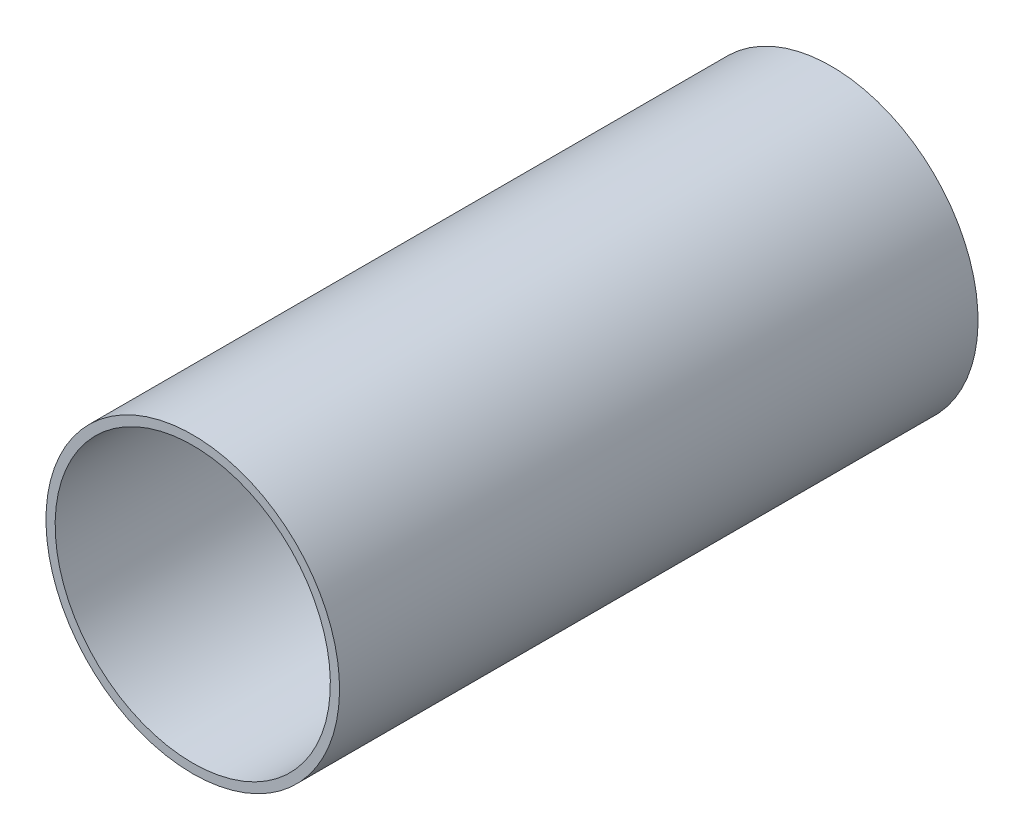
ISO-10303-21;
HEADER;
FILE_DESCRIPTION(('STEP AP214'),'2;1');
FILE_NAME('part.step','',(''),(''),'','','');
FILE_SCHEMA(('AUTOMOTIVE_DESIGN { 1 0 10303 214 1 1 1 1 }'));
ENDSEC;
DATA;
#1=APPLICATION_CONTEXT('core data for automotive mechanical design processes');
#2=APPLICATION_PROTOCOL_DEFINITION('international standard','automotive_design',2000,#1);
#3=PRODUCT_CONTEXT('',#1,'mechanical');
#4=PRODUCT('Part','Part','',(#3));
#5=PRODUCT_RELATED_PRODUCT_CATEGORY('part','',(#4));
#6=PRODUCT_DEFINITION_FORMATION('','',#4);
#7=PRODUCT_DEFINITION_CONTEXT('part definition',#1,'design');
#8=PRODUCT_DEFINITION('design','',#6,#7);
#9=PRODUCT_DEFINITION_SHAPE('','',#8);
#10=(LENGTH_UNIT() NAMED_UNIT(*) SI_UNIT(.MILLI.,.METRE.));
#11=(NAMED_UNIT(*) PLANE_ANGLE_UNIT() SI_UNIT($,.RADIAN.));
#12=(NAMED_UNIT(*) SI_UNIT($,.STERADIAN.) SOLID_ANGLE_UNIT());
#13=UNCERTAINTY_MEASURE_WITH_UNIT(LENGTH_MEASURE(1.E-05),#10,'distance_accuracy_value','');
#14=(GEOMETRIC_REPRESENTATION_CONTEXT(3) GLOBAL_UNCERTAINTY_ASSIGNED_CONTEXT((#13)) GLOBAL_UNIT_ASSIGNED_CONTEXT((#10,
#11,#12)) REPRESENTATION_CONTEXT('',''));
#15=CARTESIAN_POINT('',(0.,0.,0.));
#16=DIRECTION('',(0.,0.,1.));
#17=DIRECTION('',(1.,0.,0.));
#18=AXIS2_PLACEMENT_3D('',#15,#16,#17);
#19=CARTESIAN_POINT('',(157.48,-80.772,-0.045));
#20=DIRECTION('',(0.,0.,-1.));
#21=DIRECTION('',(0.,-1.,0.));
#22=AXIS2_PLACEMENT_3D('',#19,#20,#21);
#23=CYLINDRICAL_SURFACE('',#22,0.375);
#24=CARTESIAN_POINT('',(157.48,-80.772,-0.035));
#25=DIRECTION('',(0.,0.,-1.));
#26=DIRECTION('',(0.,-1.,0.));
#27=AXIS2_PLACEMENT_3D('',#24,#25,#26);
#28=CIRCLE('',#27,0.375);
#29=CARTESIAN_POINT('',(157.48,-81.147,-0.035));
#30=VERTEX_POINT('',#29);
#31=EDGE_CURVE('E65',#30,#30,#28,.T.);
#32=ORIENTED_EDGE('',*,*,#31,.T.);
#33=DIRECTION('',(0.,0.,1.));
#34=VECTOR('',#33,1.);
#35=CARTESIAN_POINT('',(157.48,-81.147,-0.045));
#36=LINE('',#35,#34);
#37=CARTESIAN_POINT('',(157.48,-81.147,1.705));
#38=VERTEX_POINT('',#37);
#39=EDGE_CURVE('E11',#30,#38,#36,.T.);
#40=ORIENTED_EDGE('',*,*,#39,.T.);
#41=CARTESIAN_POINT('',(157.48,-80.772,1.705));
#42=DIRECTION('',(0.,0.,-1.));
#43=DIRECTION('',(0.,-1.,0.));
#44=AXIS2_PLACEMENT_3D('',#41,#42,#43);
#45=CIRCLE('',#44,0.375);
#46=EDGE_CURVE('E26',#38,#38,#45,.T.);
#47=ORIENTED_EDGE('',*,*,#46,.F.);
#48=ORIENTED_EDGE('',*,*,#39,.F.);
#49=EDGE_LOOP('',(#32,#40,#47,#48));
#50=FACE_BOUND('',#49,.T.);
#51=ADVANCED_FACE('F17',(#50),#23,.F.);
#52=CARTESIAN_POINT('',(157.48,-81.172,1.705));
#53=DIRECTION('',(0.,0.,1.));
#54=DIRECTION('',(1.,0.,0.));
#55=AXIS2_PLACEMENT_3D('',#52,#53,#54);
#56=PLANE('',#55);
#57=ORIENTED_EDGE('',*,*,#46,.T.);
#58=EDGE_LOOP('',(#57));
#59=FACE_BOUND('',#58,.T.);
#60=CARTESIAN_POINT('',(157.48,-80.772,1.705));
#61=DIRECTION('',(0.,0.,1.));
#62=DIRECTION('',(0.,-1.,0.));
#63=AXIS2_PLACEMENT_3D('',#60,#61,#62);
#64=CIRCLE('',#63,0.4);
#65=CARTESIAN_POINT('',(157.48,-81.172,1.705));
#66=VERTEX_POINT('',#65);
#67=EDGE_CURVE('E57',#66,#66,#64,.T.);
#68=ORIENTED_EDGE('',*,*,#67,.T.);
#69=EDGE_LOOP('',(#68));
#70=FACE_BOUND('',#69,.T.);
#71=ADVANCED_FACE('F19',(#59,#70),#56,.T.);
#72=CARTESIAN_POINT('',(157.48,-81.172,-0.035));
#73=DIRECTION('',(0.,0.,1.));
#74=DIRECTION('',(1.,0.,0.));
#75=AXIS2_PLACEMENT_3D('',#72,#73,#74);
#76=PLANE('',#75);
#77=ORIENTED_EDGE('',*,*,#31,.F.);
#78=EDGE_LOOP('',(#77));
#79=FACE_BOUND('',#78,.T.);
#80=CARTESIAN_POINT('',(157.48,-80.772,-0.035));
#81=DIRECTION('',(0.,0.,1.));
#82=DIRECTION('',(0.,-1.,0.));
#83=AXIS2_PLACEMENT_3D('',#80,#81,#82);
#84=CIRCLE('',#83,0.4);
#85=CARTESIAN_POINT('',(157.48,-81.172,-0.035));
#86=VERTEX_POINT('',#85);
#87=EDGE_CURVE('E56',#86,#86,#84,.T.);
#88=ORIENTED_EDGE('',*,*,#87,.F.);
#89=EDGE_LOOP('',(#88));
#90=FACE_BOUND('',#89,.T.);
#91=ADVANCED_FACE('F82',(#79,#90),#76,.F.);
#92=CARTESIAN_POINT('',(157.48,-80.772,-0.035));
#93=DIRECTION('',(0.,0.,-1.));
#94=DIRECTION('',(0.,-1.,0.));
#95=AXIS2_PLACEMENT_3D('',#92,#93,#94);
#96=CYLINDRICAL_SURFACE('',#95,0.4);
#97=ORIENTED_EDGE('',*,*,#87,.T.);
#98=DIRECTION('',(0.,0.,1.));
#99=VECTOR('',#98,1.);
#100=CARTESIAN_POINT('',(157.48,-81.172,-0.035));
#101=LINE('',#100,#99);
#102=EDGE_CURVE('E53',#86,#66,#101,.T.);
#103=ORIENTED_EDGE('',*,*,#102,.T.);
#104=ORIENTED_EDGE('',*,*,#67,.F.);
#105=ORIENTED_EDGE('',*,*,#102,.F.);
#106=EDGE_LOOP('',(#97,#103,#104,#105));
#107=FACE_BOUND('',#106,.T.);
#108=ADVANCED_FACE('F54',(#107),#96,.T.);
#109=CLOSED_SHELL('',(#51,#71,#91,#108));
#110=MANIFOLD_SOLID_BREP('B1',#109);
#111=ADVANCED_BREP_SHAPE_REPRESENTATION('',(#18,#110),#14);
#112=SHAPE_DEFINITION_REPRESENTATION(#9,#111);
ENDSEC;
END-ISO-10303-21;
